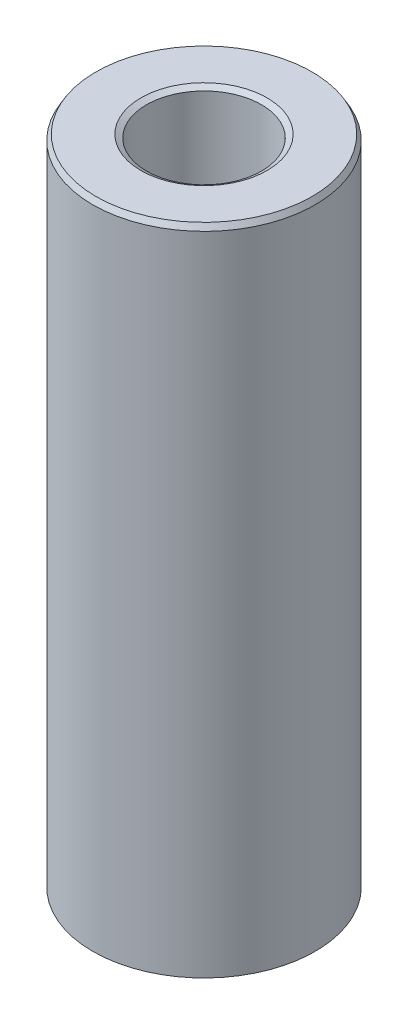
ISO-10303-21;
HEADER;
FILE_DESCRIPTION(('STEP AP214'),'2;1');
FILE_NAME('part.step','',(''),(''),'','','');
FILE_SCHEMA(('AUTOMOTIVE_DESIGN { 1 0 10303 214 1 1 1 1 }'));
ENDSEC;
DATA;
#1=APPLICATION_CONTEXT('core data for automotive mechanical design processes');
#2=APPLICATION_PROTOCOL_DEFINITION('international standard','automotive_design',2000,#1);
#3=PRODUCT_CONTEXT('',#1,'mechanical');
#4=PRODUCT('Part','Part','',(#3));
#5=PRODUCT_RELATED_PRODUCT_CATEGORY('part','',(#4));
#6=PRODUCT_DEFINITION_FORMATION('','',#4);
#7=PRODUCT_DEFINITION_CONTEXT('part definition',#1,'design');
#8=PRODUCT_DEFINITION('design','',#6,#7);
#9=PRODUCT_DEFINITION_SHAPE('','',#8);
#10=(LENGTH_UNIT() NAMED_UNIT(*) SI_UNIT(.MILLI.,.METRE.));
#11=(NAMED_UNIT(*) PLANE_ANGLE_UNIT() SI_UNIT($,.RADIAN.));
#12=(NAMED_UNIT(*) SI_UNIT($,.STERADIAN.) SOLID_ANGLE_UNIT());
#13=UNCERTAINTY_MEASURE_WITH_UNIT(LENGTH_MEASURE(1.E-05),#10,'distance_accuracy_value','');
#14=(GEOMETRIC_REPRESENTATION_CONTEXT(3) GLOBAL_UNCERTAINTY_ASSIGNED_CONTEXT((#13)) GLOBAL_UNIT_ASSIGNED_CONTEXT((#10,
#11,#12)) REPRESENTATION_CONTEXT('',''));
#15=CARTESIAN_POINT('',(0.,0.,0.));
#16=DIRECTION('',(0.,0.,1.));
#17=DIRECTION('',(1.,0.,0.));
#18=AXIS2_PLACEMENT_3D('',#15,#16,#17);
#19=CARTESIAN_POINT('',(0.,309.367168125448,0.));
#20=DIRECTION('',(0.,-1.,0.));
#21=DIRECTION('',(0.,0.,-1.));
#22=AXIS2_PLACEMENT_3D('',#19,#20,#21);
#23=CYLINDRICAL_SURFACE('',#22,52.5);
#24=CARTESIAN_POINT('',(0.,1.51234060792699,0.));
#25=DIRECTION('',(0.,1.,0.));
#26=DIRECTION('',(0.,0.,1.));
#27=AXIS2_PLACEMENT_3D('',#24,#25,#26);
#28=CIRCLE('',#27,52.5);
#29=CARTESIAN_POINT('',(0.,1.51234060792699,52.5));
#30=VERTEX_POINT('',#29);
#31=EDGE_CURVE('E10',#30,#30,#28,.T.);
#32=ORIENTED_EDGE('',*,*,#31,.T.);
#33=EDGE_LOOP('',(#32));
#34=FACE_BOUND('',#33,.T.);
#35=CARTESIAN_POINT('',(0.,306.747717354169,0.));
#36=DIRECTION('',(0.,1.,0.));
#37=DIRECTION('',(0.,0.,1.));
#38=AXIS2_PLACEMENT_3D('',#35,#36,#37);
#39=CIRCLE('',#38,52.5);
#40=CARTESIAN_POINT('',(0.,306.747717354169,52.5));
#41=VERTEX_POINT('',#40);
#42=EDGE_CURVE('E50',#41,#41,#39,.F.);
#43=ORIENTED_EDGE('',*,*,#42,.T.);
#44=EDGE_LOOP('',(#43));
#45=FACE_BOUND('',#44,.T.);
#46=ADVANCED_FACE('F39',(#34,#45),#23,.T.);
#47=CARTESIAN_POINT('',(0.,309.367168125448,0.));
#48=DIRECTION('',(0.,1.,0.));
#49=DIRECTION('',(0.,0.,1.));
#50=AXIS2_PLACEMENT_3D('',#47,#48,#49);
#51=PLANE('',#50);
#52=CARTESIAN_POINT('',(0.,309.367168125448,0.));
#53=DIRECTION('',(0.,1.,0.));
#54=DIRECTION('',(0.,0.,1.));
#55=AXIS2_PLACEMENT_3D('',#52,#53,#54);
#56=CIRCLE('',#55,29.76437605426);
#57=CARTESIAN_POINT('',(0.,309.367168125448,29.76437605426));
#58=VERTEX_POINT('',#57);
#59=EDGE_CURVE('E58',#58,#58,#56,.F.);
#60=ORIENTED_EDGE('',*,*,#59,.T.);
#61=EDGE_LOOP('',(#60));
#62=FACE_BOUND('',#61,.T.);
#63=CARTESIAN_POINT('',(0.,309.367168125448,0.));
#64=DIRECTION('',(0.,1.,0.));
#65=DIRECTION('',(0.,0.,1.));
#66=AXIS2_PLACEMENT_3D('',#63,#64,#65);
#67=CIRCLE('',#66,50.987659392073);
#68=CARTESIAN_POINT('',(0.,309.367168125448,50.987659392073));
#69=VERTEX_POINT('',#68);
#70=EDGE_CURVE('E61',#69,#69,#67,.T.);
#71=ORIENTED_EDGE('',*,*,#70,.T.);
#72=EDGE_LOOP('',(#71));
#73=FACE_BOUND('',#72,.T.);
#74=ADVANCED_FACE('F88',(#62,#73),#51,.T.);
#75=CARTESIAN_POINT('',(0.,0.,0.));
#76=DIRECTION('',(0.,1.,0.));
#77=DIRECTION('',(0.,0.,1.));
#78=AXIS2_PLACEMENT_3D('',#75,#76,#77);
#79=PLANE('',#78);
#80=CARTESIAN_POINT('',(0.,0.,0.));
#81=DIRECTION('',(0.,1.,0.));
#82=DIRECTION('',(0.,0.,1.));
#83=AXIS2_PLACEMENT_3D('',#80,#81,#82);
#84=CIRCLE('',#83,28.6572658909078);
#85=CARTESIAN_POINT('',(0.,0.,28.6572658909078));
#86=VERTEX_POINT('',#85);
#87=EDGE_CURVE('E51',#86,#86,#84,.T.);
#88=ORIENTED_EDGE('',*,*,#87,.T.);
#89=EDGE_LOOP('',(#88));
#90=FACE_BOUND('',#89,.T.);
#91=CARTESIAN_POINT('',(0.,0.,0.));
#92=DIRECTION('',(0.,1.,0.));
#93=DIRECTION('',(0.,0.,1.));
#94=AXIS2_PLACEMENT_3D('',#91,#92,#93);
#95=CIRCLE('',#94,49.8805492287208);
#96=CARTESIAN_POINT('',(0.,0.,49.8805492287208));
#97=VERTEX_POINT('',#96);
#98=EDGE_CURVE('E54',#97,#97,#95,.F.);
#99=ORIENTED_EDGE('',*,*,#98,.T.);
#100=EDGE_LOOP('',(#99));
#101=FACE_BOUND('',#100,.T.);
#102=ADVANCED_FACE('F83',(#90,#101),#79,.F.);
#103=CARTESIAN_POINT('',(0.,309.367168125448,0.));
#104=DIRECTION('',(0.,-1.,0.));
#105=DIRECTION('',(0.,0.,-1.));
#106=AXIS2_PLACEMENT_3D('',#103,#104,#105);
#107=CYLINDRICAL_SURFACE('',#106,27.1449252829808);
#108=CARTESIAN_POINT('',(0.,307.854827517521,0.));
#109=DIRECTION('',(0.,1.,0.));
#110=DIRECTION('',(0.,0.,1.));
#111=AXIS2_PLACEMENT_3D('',#108,#109,#110);
#112=CIRCLE('',#111,27.1449252829808);
#113=CARTESIAN_POINT('',(0.,307.854827517521,27.1449252829808));
#114=VERTEX_POINT('',#113);
#115=EDGE_CURVE('E67',#114,#114,#112,.T.);
#116=ORIENTED_EDGE('',*,*,#115,.T.);
#117=EDGE_LOOP('',(#116));
#118=FACE_BOUND('',#117,.T.);
#119=CARTESIAN_POINT('',(0.,2.61945077127923,0.));
#120=DIRECTION('',(0.,1.,0.));
#121=DIRECTION('',(0.,0.,1.));
#122=AXIS2_PLACEMENT_3D('',#119,#120,#121);
#123=CIRCLE('',#122,27.1449252829808);
#124=CARTESIAN_POINT('',(0.,2.61945077127923,27.1449252829808));
#125=VERTEX_POINT('',#124);
#126=EDGE_CURVE('E69',#125,#125,#123,.F.);
#127=ORIENTED_EDGE('',*,*,#126,.T.);
#128=EDGE_LOOP('',(#127));
#129=FACE_BOUND('',#128,.T.);
#130=ADVANCED_FACE('F71',(#118,#129),#107,.F.);
#131=CARTESIAN_POINT('',(0.,307.854827517521,0.));
#132=DIRECTION('',(0.,1.,0.));
#133=DIRECTION('',(0.,0.,1.));
#134=AXIS2_PLACEMENT_3D('',#131,#132,#133);
#135=CONICAL_SURFACE('',#134,27.1449252829808,1.04719755119658);
#136=ORIENTED_EDGE('',*,*,#59,.F.);
#137=EDGE_LOOP('',(#136));
#138=FACE_BOUND('',#137,.T.);
#139=ORIENTED_EDGE('',*,*,#115,.F.);
#140=EDGE_LOOP('',(#139));
#141=FACE_BOUND('',#140,.T.);
#142=ADVANCED_FACE('F77',(#138,#141),#135,.F.);
#143=CARTESIAN_POINT('',(0.,0.,0.));
#144=DIRECTION('',(0.,-1.,0.));
#145=DIRECTION('',(0.,0.,-1.));
#146=AXIS2_PLACEMENT_3D('',#143,#144,#145);
#147=CONICAL_SURFACE('',#146,28.6572658909078,0.52359877559829);
#148=ORIENTED_EDGE('',*,*,#126,.F.);
#149=EDGE_LOOP('',(#148));
#150=FACE_BOUND('',#149,.T.);
#151=ORIENTED_EDGE('',*,*,#87,.F.);
#152=EDGE_LOOP('',(#151));
#153=FACE_BOUND('',#152,.T.);
#154=ADVANCED_FACE('F73',(#150,#153),#147,.F.);
#155=CARTESIAN_POINT('',(0.,1.51234060792699,0.));
#156=DIRECTION('',(0.,1.,0.));
#157=DIRECTION('',(0.,0.,1.));
#158=AXIS2_PLACEMENT_3D('',#155,#156,#157);
#159=CONICAL_SURFACE('',#158,52.5,1.0471975511966);
#160=ORIENTED_EDGE('',*,*,#98,.F.);
#161=EDGE_LOOP('',(#160));
#162=FACE_BOUND('',#161,.T.);
#163=ORIENTED_EDGE('',*,*,#31,.F.);
#164=EDGE_LOOP('',(#163));
#165=FACE_BOUND('',#164,.T.);
#166=ADVANCED_FACE('F76',(#162,#165),#159,.T.);
#167=CARTESIAN_POINT('',(0.,309.367168125448,0.));
#168=DIRECTION('',(0.,-1.,0.));
#169=DIRECTION('',(0.,0.,-1.));
#170=AXIS2_PLACEMENT_3D('',#167,#168,#169);
#171=CONICAL_SURFACE('',#170,50.987659392073,0.523598775598296);
#172=ORIENTED_EDGE('',*,*,#42,.F.);
#173=EDGE_LOOP('',(#172));
#174=FACE_BOUND('',#173,.T.);
#175=ORIENTED_EDGE('',*,*,#70,.F.);
#176=EDGE_LOOP('',(#175));
#177=FACE_BOUND('',#176,.T.);
#178=ADVANCED_FACE('F45',(#174,#177),#171,.T.);
#179=CLOSED_SHELL('',(#46,#74,#102,#130,#142,#154,#166,#178));
#180=MANIFOLD_SOLID_BREP('B2',#179);
#181=ADVANCED_BREP_SHAPE_REPRESENTATION('',(#18,#180),#14);
#182=SHAPE_DEFINITION_REPRESENTATION(#9,#181);
ENDSEC;
END-ISO-10303-21;
